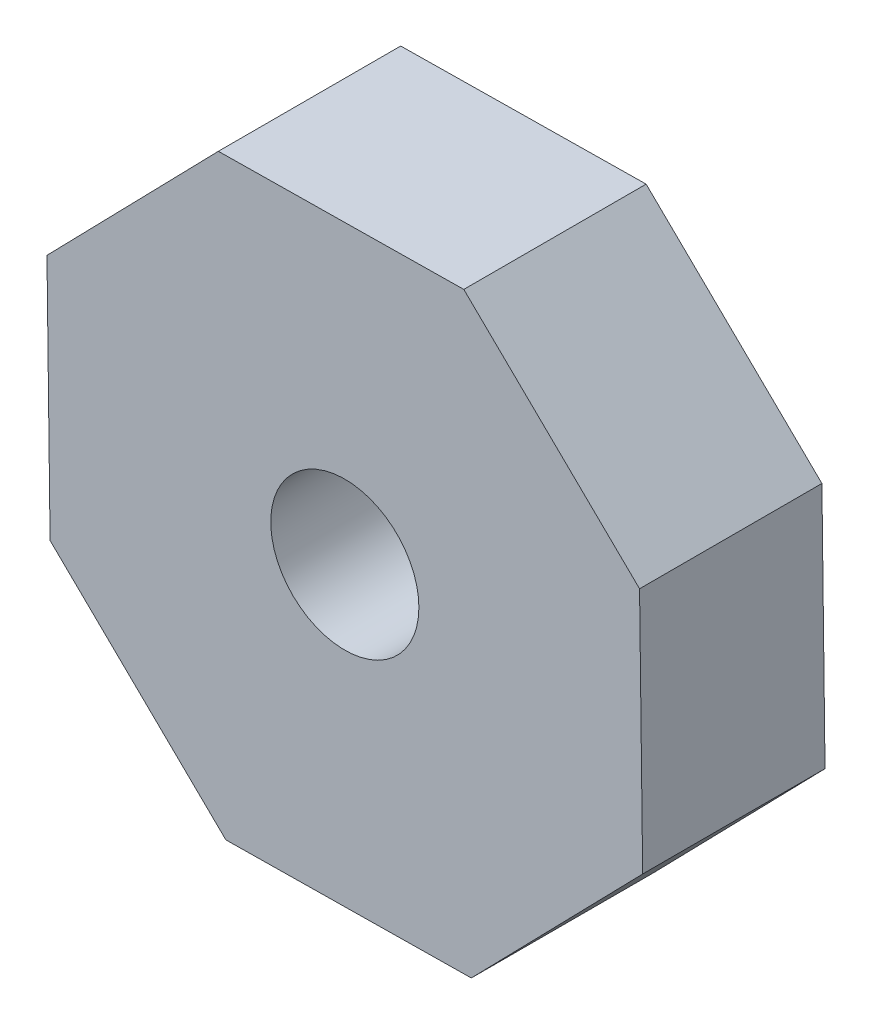
ISO-10303-21;
HEADER;
FILE_DESCRIPTION(('STEP AP214'),'2;1');
FILE_NAME('part.step','',(''),(''),'','','');
FILE_SCHEMA(('AUTOMOTIVE_DESIGN { 1 0 10303 214 1 1 1 1 }'));
ENDSEC;
DATA;
#1=APPLICATION_CONTEXT('core data for automotive mechanical design processes');
#2=APPLICATION_PROTOCOL_DEFINITION('international standard','automotive_design',2000,#1);
#3=PRODUCT_CONTEXT('',#1,'mechanical');
#4=PRODUCT('Part','Part','',(#3));
#5=PRODUCT_RELATED_PRODUCT_CATEGORY('part','',(#4));
#6=PRODUCT_DEFINITION_FORMATION('','',#4);
#7=PRODUCT_DEFINITION_CONTEXT('part definition',#1,'design');
#8=PRODUCT_DEFINITION('design','',#6,#7);
#9=PRODUCT_DEFINITION_SHAPE('','',#8);
#10=(LENGTH_UNIT() NAMED_UNIT(*) SI_UNIT(.MILLI.,.METRE.));
#11=(NAMED_UNIT(*) PLANE_ANGLE_UNIT() SI_UNIT($,.RADIAN.));
#12=(NAMED_UNIT(*) SI_UNIT($,.STERADIAN.) SOLID_ANGLE_UNIT());
#13=UNCERTAINTY_MEASURE_WITH_UNIT(LENGTH_MEASURE(1.E-05),#10,'distance_accuracy_value','');
#14=(GEOMETRIC_REPRESENTATION_CONTEXT(3) GLOBAL_UNCERTAINTY_ASSIGNED_CONTEXT((#13)) GLOBAL_UNIT_ASSIGNED_CONTEXT((#10,
#11,#12)) REPRESENTATION_CONTEXT('',''));
#15=CARTESIAN_POINT('',(0.,0.,0.));
#16=DIRECTION('',(0.,0.,1.));
#17=DIRECTION('',(1.,0.,0.));
#18=AXIS2_PLACEMENT_3D('',#15,#16,#17);
#19=CARTESIAN_POINT('',(6.53362936058939,-2.60972055169089,4.));
#20=DIRECTION('',(-0.999919545101861,-0.0126847673722206,0.));
#21=DIRECTION('',(0.0126847673722206,-0.999919545101861,0.));
#22=AXIS2_PLACEMENT_3D('',#19,#20,#21);
#23=PLANE('',#22);
#24=DIRECTION('',(-0.0126847673722206,0.999919545101861,0.));
#25=VECTOR('',#24,1.);
#26=CARTESIAN_POINT('',(6.53362936058939,-2.60972055169089,0.));
#27=LINE('',#26,#25);
#28=CARTESIAN_POINT('',(6.53362936058939,-2.60972055169089,0.));
#29=VERTEX_POINT('',#28);
#30=CARTESIAN_POINT('',(6.46532472573481,2.77462252752976,0.));
#31=VERTEX_POINT('',#30);
#32=EDGE_CURVE('E129',#29,#31,#27,.T.);
#33=ORIENTED_EDGE('',*,*,#32,.T.);
#34=DIRECTION('',(0.,0.,-1.));
#35=VECTOR('',#34,1.);
#36=CARTESIAN_POINT('',(6.46532472573481,2.77462252752976,4.));
#37=LINE('',#36,#35);
#38=CARTESIAN_POINT('',(6.46532472573481,2.77462252752976,4.));
#39=VERTEX_POINT('',#38);
#40=EDGE_CURVE('E11',#39,#31,#37,.T.);
#41=ORIENTED_EDGE('',*,*,#40,.F.);
#42=DIRECTION('',(-0.0126847673722206,0.999919545101861,0.));
#43=VECTOR('',#42,1.);
#44=CARTESIAN_POINT('',(6.53362936058939,-2.60972055169089,4.));
#45=LINE('',#44,#43);
#46=CARTESIAN_POINT('',(6.53362936058939,-2.60972055169089,4.));
#47=VERTEX_POINT('',#46);
#48=EDGE_CURVE('E144',#47,#39,#45,.T.);
#49=ORIENTED_EDGE('',*,*,#48,.F.);
#50=DIRECTION('',(0.,0.,-1.));
#51=VECTOR('',#50,1.);
#52=CARTESIAN_POINT('',(6.53362936058939,-2.60972055169089,4.));
#53=LINE('',#52,#51);
#54=EDGE_CURVE('E125',#47,#29,#53,.T.);
#55=ORIENTED_EDGE('',*,*,#54,.T.);
#56=EDGE_LOOP('',(#33,#41,#49,#55));
#57=FACE_BOUND('',#56,.T.);
#58=ADVANCED_FACE('F33',(#57),#23,.F.);
#59=CARTESIAN_POINT('',(6.46532472573481,2.77462252752976,4.));
#60=DIRECTION('',(-0.698080405955822,-0.716019376009165,0.));
#61=DIRECTION('',(0.716019376009165,-0.698080405955822,0.));
#62=AXIS2_PLACEMENT_3D('',#59,#60,#61);
#63=PLANE('',#62);
#64=DIRECTION('',(-0.716019376009165,0.698080405955823,0.));
#65=VECTOR('',#64,1.);
#66=CARTESIAN_POINT('',(6.46532472573481,2.77462252752976,0.));
#67=LINE('',#66,#65);
#68=CARTESIAN_POINT('',(2.60972055169089,6.53362936058939,0.));
#69=VERTEX_POINT('',#68);
#70=EDGE_CURVE('E132',#31,#69,#67,.T.);
#71=ORIENTED_EDGE('',*,*,#70,.T.);
#72=DIRECTION('',(0.,0.,-1.));
#73=VECTOR('',#72,1.);
#74=CARTESIAN_POINT('',(2.60972055169089,6.53362936058939,4.));
#75=LINE('',#74,#73);
#76=CARTESIAN_POINT('',(2.60972055169089,6.53362936058939,4.));
#77=VERTEX_POINT('',#76);
#78=EDGE_CURVE('E41',#77,#69,#75,.T.);
#79=ORIENTED_EDGE('',*,*,#78,.F.);
#80=DIRECTION('',(-0.716019376009165,0.698080405955823,0.));
#81=VECTOR('',#80,1.);
#82=CARTESIAN_POINT('',(6.46532472573481,2.77462252752976,4.));
#83=LINE('',#82,#81);
#84=EDGE_CURVE('E92',#39,#77,#83,.T.);
#85=ORIENTED_EDGE('',*,*,#84,.F.);
#86=ORIENTED_EDGE('',*,*,#40,.T.);
#87=EDGE_LOOP('',(#71,#79,#85,#86));
#88=FACE_BOUND('',#87,.T.);
#89=ADVANCED_FACE('F200',(#88),#63,.F.);
#90=CARTESIAN_POINT('',(2.60972055169089,6.53362936058939,4.));
#91=DIRECTION('',(0.0126847673722208,-0.999919545101861,0.));
#92=DIRECTION('',(0.999919545101861,0.0126847673722208,0.));
#93=AXIS2_PLACEMENT_3D('',#90,#91,#92);
#94=PLANE('',#93);
#95=DIRECTION('',(-0.999919545101861,-0.0126847673722208,0.));
#96=VECTOR('',#95,1.);
#97=CARTESIAN_POINT('',(2.60972055169089,6.53362936058939,0.));
#98=LINE('',#97,#96);
#99=CARTESIAN_POINT('',(-2.77462252752976,6.46532472573481,0.));
#100=VERTEX_POINT('',#99);
#101=EDGE_CURVE('E135',#69,#100,#98,.T.);
#102=ORIENTED_EDGE('',*,*,#101,.T.);
#103=DIRECTION('',(0.,0.,-1.));
#104=VECTOR('',#103,1.);
#105=CARTESIAN_POINT('',(-2.77462252752976,6.46532472573481,4.));
#106=LINE('',#105,#104);
#107=CARTESIAN_POINT('',(-2.77462252752976,6.46532472573481,4.));
#108=VERTEX_POINT('',#107);
#109=EDGE_CURVE('E151',#108,#100,#106,.T.);
#110=ORIENTED_EDGE('',*,*,#109,.F.);
#111=DIRECTION('',(-0.999919545101861,-0.0126847673722208,0.));
#112=VECTOR('',#111,1.);
#113=CARTESIAN_POINT('',(2.60972055169089,6.53362936058939,4.));
#114=LINE('',#113,#112);
#115=EDGE_CURVE('E159',#77,#108,#114,.T.);
#116=ORIENTED_EDGE('',*,*,#115,.F.);
#117=ORIENTED_EDGE('',*,*,#78,.T.);
#118=EDGE_LOOP('',(#102,#110,#116,#117));
#119=FACE_BOUND('',#118,.T.);
#120=ADVANCED_FACE('F157',(#119),#94,.F.);
#121=CARTESIAN_POINT('',(-2.77462252752976,6.46532472573481,4.));
#122=DIRECTION('',(0.716019376009165,-0.698080405955823,0.));
#123=DIRECTION('',(0.698080405955823,0.716019376009165,0.));
#124=AXIS2_PLACEMENT_3D('',#121,#122,#123);
#125=PLANE('',#124);
#126=DIRECTION('',(-0.698080405955823,-0.716019376009165,0.));
#127=VECTOR('',#126,1.);
#128=CARTESIAN_POINT('',(-2.77462252752976,6.46532472573481,0.));
#129=LINE('',#128,#127);
#130=CARTESIAN_POINT('',(-6.53362936058939,2.60972055169089,0.));
#131=VERTEX_POINT('',#130);
#132=EDGE_CURVE('E137',#100,#131,#129,.T.);
#133=ORIENTED_EDGE('',*,*,#132,.T.);
#134=DIRECTION('',(0.,0.,-1.));
#135=VECTOR('',#134,1.);
#136=CARTESIAN_POINT('',(-6.53362936058939,2.60972055169089,4.));
#137=LINE('',#136,#135);
#138=CARTESIAN_POINT('',(-6.53362936058939,2.60972055169089,4.));
#139=VERTEX_POINT('',#138);
#140=EDGE_CURVE('E148',#139,#131,#137,.T.);
#141=ORIENTED_EDGE('',*,*,#140,.F.);
#142=DIRECTION('',(-0.698080405955823,-0.716019376009165,0.));
#143=VECTOR('',#142,1.);
#144=CARTESIAN_POINT('',(-2.77462252752976,6.46532472573481,4.));
#145=LINE('',#144,#143);
#146=EDGE_CURVE('E171',#108,#139,#145,.T.);
#147=ORIENTED_EDGE('',*,*,#146,.F.);
#148=ORIENTED_EDGE('',*,*,#109,.T.);
#149=EDGE_LOOP('',(#133,#141,#147,#148));
#150=FACE_BOUND('',#149,.T.);
#151=ADVANCED_FACE('F167',(#150),#125,.F.);
#152=CARTESIAN_POINT('',(-6.53362936058939,2.60972055169089,4.));
#153=DIRECTION('',(0.999919545101861,0.0126847673722208,0.));
#154=DIRECTION('',(-0.0126847673722208,0.999919545101861,0.));
#155=AXIS2_PLACEMENT_3D('',#152,#153,#154);
#156=PLANE('',#155);
#157=DIRECTION('',(0.0126847673722208,-0.999919545101861,0.));
#158=VECTOR('',#157,1.);
#159=CARTESIAN_POINT('',(-6.53362936058939,2.60972055169089,0.));
#160=LINE('',#159,#158);
#161=CARTESIAN_POINT('',(-6.46532472573481,-2.77462252752976,0.));
#162=VERTEX_POINT('',#161);
#163=EDGE_CURVE('E139',#131,#162,#160,.T.);
#164=ORIENTED_EDGE('',*,*,#163,.T.);
#165=DIRECTION('',(0.,0.,-1.));
#166=VECTOR('',#165,1.);
#167=CARTESIAN_POINT('',(-6.46532472573481,-2.77462252752976,4.));
#168=LINE('',#167,#166);
#169=CARTESIAN_POINT('',(-6.46532472573481,-2.77462252752976,4.));
#170=VERTEX_POINT('',#169);
#171=EDGE_CURVE('E120',#170,#162,#168,.T.);
#172=ORIENTED_EDGE('',*,*,#171,.F.);
#173=DIRECTION('',(0.0126847673722208,-0.999919545101861,0.));
#174=VECTOR('',#173,1.);
#175=CARTESIAN_POINT('',(-6.53362936058939,2.60972055169089,4.));
#176=LINE('',#175,#174);
#177=EDGE_CURVE('E111',#139,#170,#176,.T.);
#178=ORIENTED_EDGE('',*,*,#177,.F.);
#179=ORIENTED_EDGE('',*,*,#140,.T.);
#180=EDGE_LOOP('',(#164,#172,#178,#179));
#181=FACE_BOUND('',#180,.T.);
#182=ADVANCED_FACE('F170',(#181),#156,.F.);
#183=CARTESIAN_POINT('',(-6.46532472573481,-2.77462252752976,4.));
#184=DIRECTION('',(0.698080405955823,0.716019376009165,0.));
#185=DIRECTION('',(-0.716019376009165,0.698080405955823,0.));
#186=AXIS2_PLACEMENT_3D('',#183,#184,#185);
#187=PLANE('',#186);
#188=DIRECTION('',(0.716019376009165,-0.698080405955823,0.));
#189=VECTOR('',#188,1.);
#190=CARTESIAN_POINT('',(-6.46532472573481,-2.77462252752976,0.));
#191=LINE('',#190,#189);
#192=CARTESIAN_POINT('',(-2.60972055169088,-6.53362936058939,0.));
#193=VERTEX_POINT('',#192);
#194=EDGE_CURVE('E119',#162,#193,#191,.T.);
#195=ORIENTED_EDGE('',*,*,#194,.T.);
#196=DIRECTION('',(0.,0.,-1.));
#197=VECTOR('',#196,1.);
#198=CARTESIAN_POINT('',(-2.60972055169088,-6.53362936058939,4.));
#199=LINE('',#198,#197);
#200=CARTESIAN_POINT('',(-2.60972055169088,-6.53362936058939,4.));
#201=VERTEX_POINT('',#200);
#202=EDGE_CURVE('E116',#201,#193,#199,.T.);
#203=ORIENTED_EDGE('',*,*,#202,.F.);
#204=DIRECTION('',(0.716019376009165,-0.698080405955823,0.));
#205=VECTOR('',#204,1.);
#206=CARTESIAN_POINT('',(-6.46532472573481,-2.77462252752976,4.));
#207=LINE('',#206,#205);
#208=EDGE_CURVE('E105',#170,#201,#207,.T.);
#209=ORIENTED_EDGE('',*,*,#208,.F.);
#210=ORIENTED_EDGE('',*,*,#171,.T.);
#211=EDGE_LOOP('',(#195,#203,#209,#210));
#212=FACE_BOUND('',#211,.T.);
#213=ADVANCED_FACE('F117',(#212),#187,.F.);
#214=CARTESIAN_POINT('',(-2.60972055169088,-6.53362936058939,4.));
#215=DIRECTION('',(-0.0126847673722208,0.999919545101861,0.));
#216=DIRECTION('',(-0.999919545101861,-0.0126847673722208,0.));
#217=AXIS2_PLACEMENT_3D('',#214,#215,#216);
#218=PLANE('',#217);
#219=DIRECTION('',(0.999919545101861,0.0126847673722208,0.));
#220=VECTOR('',#219,1.);
#221=CARTESIAN_POINT('',(-2.60972055169088,-6.53362936058939,0.));
#222=LINE('',#221,#220);
#223=CARTESIAN_POINT('',(2.77462252752976,-6.46532472573481,0.));
#224=VERTEX_POINT('',#223);
#225=EDGE_CURVE('E78',#193,#224,#222,.T.);
#226=ORIENTED_EDGE('',*,*,#225,.T.);
#227=DIRECTION('',(0.,0.,-1.));
#228=VECTOR('',#227,1.);
#229=CARTESIAN_POINT('',(2.77462252752976,-6.46532472573481,4.));
#230=LINE('',#229,#228);
#231=CARTESIAN_POINT('',(2.77462252752976,-6.46532472573481,4.));
#232=VERTEX_POINT('',#231);
#233=EDGE_CURVE('E121',#232,#224,#230,.T.);
#234=ORIENTED_EDGE('',*,*,#233,.F.);
#235=DIRECTION('',(0.999919545101861,0.0126847673722208,0.));
#236=VECTOR('',#235,1.);
#237=CARTESIAN_POINT('',(-2.60972055169088,-6.53362936058939,4.));
#238=LINE('',#237,#236);
#239=EDGE_CURVE('E109',#201,#232,#238,.T.);
#240=ORIENTED_EDGE('',*,*,#239,.F.);
#241=ORIENTED_EDGE('',*,*,#202,.T.);
#242=EDGE_LOOP('',(#226,#234,#240,#241));
#243=FACE_BOUND('',#242,.T.);
#244=ADVANCED_FACE('F123',(#243),#218,.F.);
#245=CARTESIAN_POINT('',(2.77462252752976,-6.46532472573481,4.));
#246=DIRECTION('',(-0.716019376009165,0.698080405955823,0.));
#247=DIRECTION('',(-0.698080405955823,-0.716019376009165,0.));
#248=AXIS2_PLACEMENT_3D('',#245,#246,#247);
#249=PLANE('',#248);
#250=DIRECTION('',(0.698080405955823,0.716019376009165,0.));
#251=VECTOR('',#250,1.);
#252=CARTESIAN_POINT('',(2.77462252752976,-6.46532472573481,0.));
#253=LINE('',#252,#251);
#254=EDGE_CURVE('E84',#224,#29,#253,.T.);
#255=ORIENTED_EDGE('',*,*,#254,.T.);
#256=ORIENTED_EDGE('',*,*,#54,.F.);
#257=DIRECTION('',(0.698080405955823,0.716019376009165,0.));
#258=VECTOR('',#257,1.);
#259=CARTESIAN_POINT('',(2.77462252752976,-6.46532472573481,4.));
#260=LINE('',#259,#258);
#261=EDGE_CURVE('E49',#232,#47,#260,.T.);
#262=ORIENTED_EDGE('',*,*,#261,.F.);
#263=ORIENTED_EDGE('',*,*,#233,.T.);
#264=EDGE_LOOP('',(#255,#256,#262,#263));
#265=FACE_BOUND('',#264,.T.);
#266=ADVANCED_FACE('F191',(#265),#249,.F.);
#267=CARTESIAN_POINT('',(0.,0.,4.));
#268=DIRECTION('',(0.,0.,1.));
#269=DIRECTION('',(1.,0.,0.));
#270=AXIS2_PLACEMENT_3D('',#267,#268,#269);
#271=PLANE('',#270);
#272=CARTESIAN_POINT('',(0.,0.,4.));
#273=DIRECTION('',(0.,0.,1.));
#274=DIRECTION('',(1.,0.,0.));
#275=AXIS2_PLACEMENT_3D('',#272,#273,#274);
#276=CIRCLE('',#275,1.625);
#277=CARTESIAN_POINT('',(1.625,0.,4.));
#278=VERTEX_POINT('',#277);
#279=EDGE_CURVE('E177',#278,#278,#276,.T.);
#280=ORIENTED_EDGE('',*,*,#279,.F.);
#281=EDGE_LOOP('',(#280));
#282=FACE_BOUND('',#281,.T.);
#283=ORIENTED_EDGE('',*,*,#48,.T.);
#284=ORIENTED_EDGE('',*,*,#84,.T.);
#285=ORIENTED_EDGE('',*,*,#115,.T.);
#286=ORIENTED_EDGE('',*,*,#146,.T.);
#287=ORIENTED_EDGE('',*,*,#177,.T.);
#288=ORIENTED_EDGE('',*,*,#208,.T.);
#289=ORIENTED_EDGE('',*,*,#239,.T.);
#290=ORIENTED_EDGE('',*,*,#261,.T.);
#291=EDGE_LOOP('',(#283,#284,#285,#286,#287,#288,#289,#290));
#292=FACE_BOUND('',#291,.T.);
#293=ADVANCED_FACE('F107',(#282,#292),#271,.T.);
#294=CARTESIAN_POINT('',(0.,0.,0.));
#295=DIRECTION('',(0.,0.,1.));
#296=DIRECTION('',(1.,0.,0.));
#297=AXIS2_PLACEMENT_3D('',#294,#295,#296);
#298=PLANE('',#297);
#299=CARTESIAN_POINT('',(0.,0.,0.));
#300=DIRECTION('',(0.,0.,1.));
#301=DIRECTION('',(1.,0.,0.));
#302=AXIS2_PLACEMENT_3D('',#299,#300,#301);
#303=CIRCLE('',#302,1.625);
#304=CARTESIAN_POINT('',(1.625,0.,0.));
#305=VERTEX_POINT('',#304);
#306=EDGE_CURVE('E133',#305,#305,#303,.T.);
#307=ORIENTED_EDGE('',*,*,#306,.T.);
#308=EDGE_LOOP('',(#307));
#309=FACE_BOUND('',#308,.T.);
#310=ORIENTED_EDGE('',*,*,#32,.F.);
#311=ORIENTED_EDGE('',*,*,#254,.F.);
#312=ORIENTED_EDGE('',*,*,#225,.F.);
#313=ORIENTED_EDGE('',*,*,#194,.F.);
#314=ORIENTED_EDGE('',*,*,#163,.F.);
#315=ORIENTED_EDGE('',*,*,#132,.F.);
#316=ORIENTED_EDGE('',*,*,#101,.F.);
#317=ORIENTED_EDGE('',*,*,#70,.F.);
#318=EDGE_LOOP('',(#310,#311,#312,#313,#314,#315,#316,#317));
#319=FACE_BOUND('',#318,.T.);
#320=ADVANCED_FACE('F163',(#309,#319),#298,.F.);
#321=CARTESIAN_POINT('',(0.,0.,0.));
#322=DIRECTION('',(0.,0.,1.));
#323=DIRECTION('',(1.,0.,0.));
#324=AXIS2_PLACEMENT_3D('',#321,#322,#323);
#325=CYLINDRICAL_SURFACE('',#324,1.625);
#326=ORIENTED_EDGE('',*,*,#306,.F.);
#327=EDGE_LOOP('',(#326));
#328=FACE_BOUND('',#327,.T.);
#329=ORIENTED_EDGE('',*,*,#279,.T.);
#330=EDGE_LOOP('',(#329));
#331=FACE_BOUND('',#330,.T.);
#332=ADVANCED_FACE('F184',(#328,#331),#325,.F.);
#333=CLOSED_SHELL('',(#58,#89,#120,#151,#182,#213,#244,#266,#293,#320,#332));
#334=MANIFOLD_SOLID_BREP('B2',#333);
#335=ADVANCED_BREP_SHAPE_REPRESENTATION('',(#18,#334),#14);
#336=SHAPE_DEFINITION_REPRESENTATION(#9,#335);
ENDSEC;
END-ISO-10303-21;
